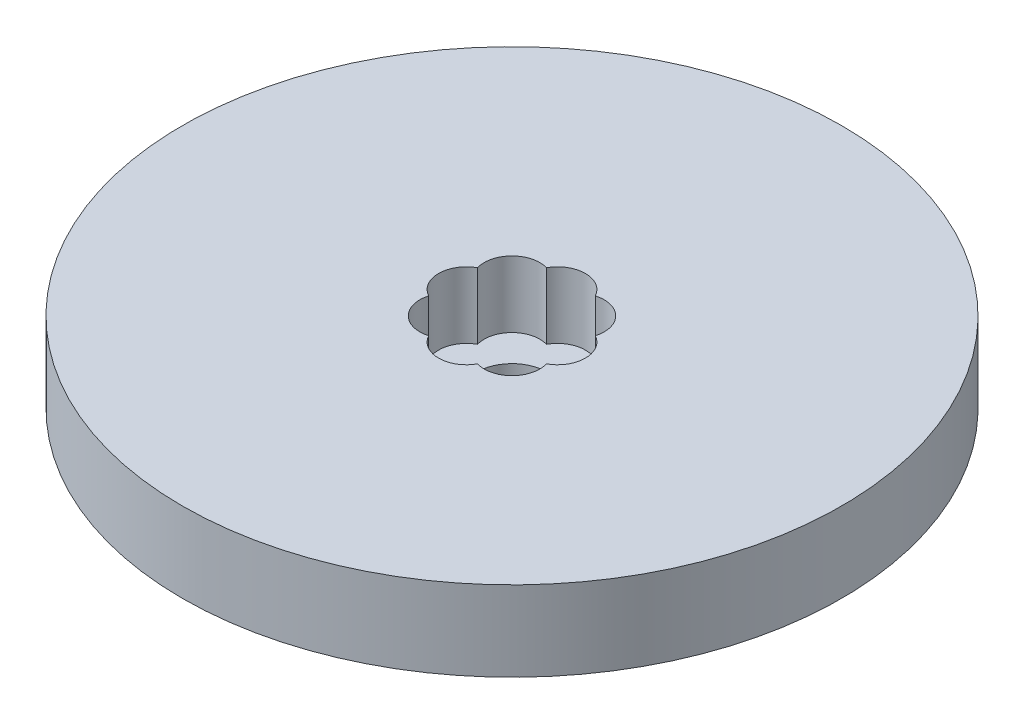
ISO-10303-21;
HEADER;
FILE_DESCRIPTION(('STEP AP214'),'2;1');
FILE_NAME('part.step','',(''),(''),'','','');
FILE_SCHEMA(('AUTOMOTIVE_DESIGN { 1 0 10303 214 1 1 1 1 }'));
ENDSEC;
DATA;
#1=APPLICATION_CONTEXT('core data for automotive mechanical design processes');
#2=APPLICATION_PROTOCOL_DEFINITION('international standard','automotive_design',2000,#1);
#3=PRODUCT_CONTEXT('',#1,'mechanical');
#4=PRODUCT('Part','Part','',(#3));
#5=PRODUCT_RELATED_PRODUCT_CATEGORY('part','',(#4));
#6=PRODUCT_DEFINITION_FORMATION('','',#4);
#7=PRODUCT_DEFINITION_CONTEXT('part definition',#1,'design');
#8=PRODUCT_DEFINITION('design','',#6,#7);
#9=PRODUCT_DEFINITION_SHAPE('','',#8);
#10=(LENGTH_UNIT() NAMED_UNIT(*) SI_UNIT(.MILLI.,.METRE.));
#11=(NAMED_UNIT(*) PLANE_ANGLE_UNIT() SI_UNIT($,.RADIAN.));
#12=(NAMED_UNIT(*) SI_UNIT($,.STERADIAN.) SOLID_ANGLE_UNIT());
#13=UNCERTAINTY_MEASURE_WITH_UNIT(LENGTH_MEASURE(1.E-05),#10,'distance_accuracy_value','');
#14=(GEOMETRIC_REPRESENTATION_CONTEXT(3) GLOBAL_UNCERTAINTY_ASSIGNED_CONTEXT((#13)) GLOBAL_UNIT_ASSIGNED_CONTEXT((#10,
#11,#12)) REPRESENTATION_CONTEXT('',''));
#15=CARTESIAN_POINT('',(0.,0.,0.));
#16=DIRECTION('',(0.,0.,1.));
#17=DIRECTION('',(1.,0.,0.));
#18=AXIS2_PLACEMENT_3D('',#15,#16,#17);
#19=CARTESIAN_POINT('',(0.,17.,0.));
#20=DIRECTION('',(0.,-1.,0.));
#21=DIRECTION('',(0.,0.,-1.));
#22=AXIS2_PLACEMENT_3D('',#19,#20,#21);
#23=CYLINDRICAL_SURFACE('',#22,7.5);
#24=CARTESIAN_POINT('',(0.,0.,0.));
#25=DIRECTION('',(0.,1.,0.));
#26=DIRECTION('',(0.,0.,1.));
#27=AXIS2_PLACEMENT_3D('',#24,#25,#26);
#28=CIRCLE('',#27,7.5);
#29=CARTESIAN_POINT('',(0.,0.,7.5));
#30=VERTEX_POINT('',#29);
#31=EDGE_CURVE('E166',#30,#30,#28,.T.);
#32=ORIENTED_EDGE('',*,*,#31,.F.);
#33=EDGE_LOOP('',(#32));
#34=FACE_BOUND('',#33,.T.);
#35=CARTESIAN_POINT('',(0.,2.90271990847915,0.));
#36=DIRECTION('',(0.,1.,0.));
#37=DIRECTION('',(0.,0.,1.));
#38=AXIS2_PLACEMENT_3D('',#35,#36,#37);
#39=CIRCLE('',#38,7.5);
#40=CARTESIAN_POINT('',(0.,2.90271990847915,7.5));
#41=VERTEX_POINT('',#40);
#42=EDGE_CURVE('E11',#41,#41,#39,.T.);
#43=ORIENTED_EDGE('',*,*,#42,.T.);
#44=EDGE_LOOP('',(#43));
#45=FACE_BOUND('',#44,.T.);
#46=ADVANCED_FACE('F39',(#34,#45),#23,.F.);
#47=CARTESIAN_POINT('',(0.,17.,0.));
#48=DIRECTION('',(0.,-1.,0.));
#49=DIRECTION('',(0.,0.,-1.));
#50=AXIS2_PLACEMENT_3D('',#47,#48,#49);
#51=CYLINDRICAL_SURFACE('',#50,70.);
#52=CARTESIAN_POINT('',(0.,17.,0.));
#53=DIRECTION('',(0.,1.,0.));
#54=DIRECTION('',(0.,0.,1.));
#55=AXIS2_PLACEMENT_3D('',#52,#53,#54);
#56=CIRCLE('',#55,70.);
#57=CARTESIAN_POINT('',(0.,17.,70.));
#58=VERTEX_POINT('',#57);
#59=EDGE_CURVE('E50',#58,#58,#56,.T.);
#60=ORIENTED_EDGE('',*,*,#59,.F.);
#61=EDGE_LOOP('',(#60));
#62=FACE_BOUND('',#61,.T.);
#63=CARTESIAN_POINT('',(0.,0.,0.));
#64=DIRECTION('',(0.,1.,0.));
#65=DIRECTION('',(0.,0.,1.));
#66=AXIS2_PLACEMENT_3D('',#63,#64,#65);
#67=CIRCLE('',#66,70.);
#68=CARTESIAN_POINT('',(0.,0.,70.));
#69=VERTEX_POINT('',#68);
#70=EDGE_CURVE('E173',#69,#69,#67,.T.);
#71=ORIENTED_EDGE('',*,*,#70,.T.);
#72=EDGE_LOOP('',(#71));
#73=FACE_BOUND('',#72,.T.);
#74=ADVANCED_FACE('F41',(#62,#73),#51,.T.);
#75=CARTESIAN_POINT('',(0.,17.,0.));
#76=DIRECTION('',(0.,1.,0.));
#77=DIRECTION('',(0.,0.,1.));
#78=AXIS2_PLACEMENT_3D('',#75,#76,#77);
#79=PLANE('',#78);
#80=CARTESIAN_POINT('',(-6.84222450603892,17.,6.84222450603894));
#81=DIRECTION('',(0.,1.,0.));
#82=DIRECTION('',(0.707106781186549,0.,0.707106781186546));
#83=AXIS2_PLACEMENT_3D('',#80,#81,#82);
#84=CIRCLE('',#83,5.90603717676295);
#85=CARTESIAN_POINT('',(-12.5100627786906,17.,5.18183766907249));
#86=VERTEX_POINT('',#85);
#87=CARTESIAN_POINT('',(-5.18183766907244,17.,12.5100627786906));
#88=VERTEX_POINT('',#87);
#89=EDGE_CURVE('E159',#86,#88,#84,.T.);
#90=ORIENTED_EDGE('',*,*,#89,.F.);
#91=CARTESIAN_POINT('',(-9.67636669324181,17.,0.));
#92=DIRECTION('',(0.,1.,0.));
#93=DIRECTION('',(0.,0.,1.));
#94=AXIS2_PLACEMENT_3D('',#91,#92,#93);
#95=CIRCLE('',#94,5.90603717676295);
#96=CARTESIAN_POINT('',(-12.5100627786907,17.,-5.18183766907243));
#97=VERTEX_POINT('',#96);
#98=EDGE_CURVE('E167',#97,#86,#95,.T.);
#99=ORIENTED_EDGE('',*,*,#98,.F.);
#100=CARTESIAN_POINT('',(-6.84222450603901,17.,-6.84222450603885));
#101=DIRECTION('',(0.,1.,0.));
#102=DIRECTION('',(-0.707106781186539,0.,0.707106781186556));
#103=AXIS2_PLACEMENT_3D('',#100,#101,#102);
#104=CIRCLE('',#103,5.90603717676295);
#105=CARTESIAN_POINT('',(-5.18183766907262,17.,-12.5100627786905));
#106=VERTEX_POINT('',#105);
#107=EDGE_CURVE('E53',#106,#97,#104,.T.);
#108=ORIENTED_EDGE('',*,*,#107,.F.);
#109=CARTESIAN_POINT('',(-1.01354561211771E-13,17.,-9.67636669324181));
#110=DIRECTION('',(0.,1.,0.));
#111=DIRECTION('',(-1.,0.,0.));
#112=AXIS2_PLACEMENT_3D('',#109,#110,#111);
#113=CIRCLE('',#112,5.90603717676295);
#114=CARTESIAN_POINT('',(5.18183766907236,17.,-12.5100627786906));
#115=VERTEX_POINT('',#114);
#116=EDGE_CURVE('E117',#115,#106,#113,.T.);
#117=ORIENTED_EDGE('',*,*,#116,.F.);
#118=CARTESIAN_POINT('',(6.84222450603887,17.,-6.84222450603899));
#119=DIRECTION('',(0.,1.,0.));
#120=DIRECTION('',(-0.707106781186554,0.,-0.707106781186541));
#121=AXIS2_PLACEMENT_3D('',#118,#119,#120);
#122=CIRCLE('',#121,5.90603717676295);
#123=CARTESIAN_POINT('',(12.5100627786905,17.,-5.18183766907252));
#124=VERTEX_POINT('',#123);
#125=EDGE_CURVE('E120',#124,#115,#122,.T.);
#126=ORIENTED_EDGE('',*,*,#125,.F.);
#127=CARTESIAN_POINT('',(9.67636669324181,17.,0.));
#128=DIRECTION('',(0.,1.,0.));
#129=DIRECTION('',(0.,0.,-1.));
#130=AXIS2_PLACEMENT_3D('',#127,#128,#129);
#131=CIRCLE('',#130,5.90603717676295);
#132=CARTESIAN_POINT('',(12.5100627786906,17.,5.18183766907246));
#133=VERTEX_POINT('',#132);
#134=EDGE_CURVE('E136',#133,#124,#131,.T.);
#135=ORIENTED_EDGE('',*,*,#134,.F.);
#136=CARTESIAN_POINT('',(6.84222450603897,17.,6.84222450603889));
#137=DIRECTION('',(0.,1.,0.));
#138=DIRECTION('',(0.707106781186544,0.,-0.707106781186551));
#139=AXIS2_PLACEMENT_3D('',#136,#137,#138);
#140=CIRCLE('',#139,5.90603717676295);
#141=CARTESIAN_POINT('',(5.18183766907253,17.,12.5100627786905));
#142=VERTEX_POINT('',#141);
#143=EDGE_CURVE('E138',#142,#133,#140,.T.);
#144=ORIENTED_EDGE('',*,*,#143,.F.);
#145=CARTESIAN_POINT('',(0.,17.,9.67636669324181));
#146=DIRECTION('',(0.,1.,0.));
#147=DIRECTION('',(1.,0.,0.));
#148=AXIS2_PLACEMENT_3D('',#145,#146,#147);
#149=CIRCLE('',#148,5.90603717676295);
#150=EDGE_CURVE('E146',#88,#142,#149,.T.);
#151=ORIENTED_EDGE('',*,*,#150,.F.);
#152=EDGE_LOOP('',(#90,#99,#108,#117,#126,#135,#144,#151));
#153=FACE_BOUND('',#152,.T.);
#154=ORIENTED_EDGE('',*,*,#59,.T.);
#155=EDGE_LOOP('',(#154));
#156=FACE_BOUND('',#155,.T.);
#157=ADVANCED_FACE('F181',(#153,#156),#79,.T.);
#158=CARTESIAN_POINT('',(0.,0.,0.));
#159=DIRECTION('',(0.,1.,0.));
#160=DIRECTION('',(0.,0.,1.));
#161=AXIS2_PLACEMENT_3D('',#158,#159,#160);
#162=PLANE('',#161);
#163=ORIENTED_EDGE('',*,*,#31,.T.);
#164=EDGE_LOOP('',(#163));
#165=FACE_BOUND('',#164,.T.);
#166=ORIENTED_EDGE('',*,*,#70,.F.);
#167=EDGE_LOOP('',(#166));
#168=FACE_BOUND('',#167,.T.);
#169=ADVANCED_FACE('F179',(#165,#168),#162,.F.);
#170=CARTESIAN_POINT('',(-9.67636669324181,2.90271990847915,0.));
#171=DIRECTION('',(0.,1.,0.));
#172=DIRECTION('',(0.,0.,1.));
#173=AXIS2_PLACEMENT_3D('',#170,#171,#172);
#174=CYLINDRICAL_SURFACE('',#173,5.90603717676295);
#175=ORIENTED_EDGE('',*,*,#98,.T.);
#176=DIRECTION('',(0.,1.,0.));
#177=VECTOR('',#176,1.);
#178=CARTESIAN_POINT('',(-12.5100627786906,9.95135995423958,5.18183766907249));
#179=LINE('',#178,#177);
#180=CARTESIAN_POINT('',(-12.5100627786906,2.90271990847915,5.18183766907249));
#181=VERTEX_POINT('',#180);
#182=EDGE_CURVE('E65',#86,#181,#179,.F.);
#183=ORIENTED_EDGE('',*,*,#182,.T.);
#184=CARTESIAN_POINT('',(-9.67636669324181,2.90271990847915,0.));
#185=DIRECTION('',(0.,1.,0.));
#186=DIRECTION('',(0.,0.,1.));
#187=AXIS2_PLACEMENT_3D('',#184,#185,#186);
#188=CIRCLE('',#187,5.90603717676295);
#189=CARTESIAN_POINT('',(-12.5100627786907,2.90271990847915,-5.18183766907243));
#190=VERTEX_POINT('',#189);
#191=EDGE_CURVE('E170',#190,#181,#188,.T.);
#192=ORIENTED_EDGE('',*,*,#191,.F.);
#193=DIRECTION('',(0.,1.,0.));
#194=VECTOR('',#193,1.);
#195=CARTESIAN_POINT('',(-12.5100627786907,9.95135995423958,-5.18183766907243));
#196=LINE('',#195,#194);
#197=EDGE_CURVE('E124',#190,#97,#196,.T.);
#198=ORIENTED_EDGE('',*,*,#197,.T.);
#199=EDGE_LOOP('',(#175,#183,#192,#198));
#200=FACE_BOUND('',#199,.T.);
#201=ADVANCED_FACE('F185',(#200),#174,.F.);
#202=CARTESIAN_POINT('',(-9.67636669324181,2.90271990847915,0.));
#203=DIRECTION('',(0.,1.,0.));
#204=DIRECTION('',(0.,0.,1.));
#205=AXIS2_PLACEMENT_3D('',#202,#203,#204);
#206=PLANE('',#205);
#207=ORIENTED_EDGE('',*,*,#191,.T.);
#208=CARTESIAN_POINT('',(-6.84222450603892,2.90271990847915,6.84222450603894));
#209=DIRECTION('',(0.,1.,0.));
#210=DIRECTION('',(0.707106781186549,0.,0.707106781186546));
#211=AXIS2_PLACEMENT_3D('',#208,#209,#210);
#212=CIRCLE('',#211,5.90603717676295);
#213=CARTESIAN_POINT('',(-5.18183766907244,2.90271990847915,12.5100627786906));
#214=VERTEX_POINT('',#213);
#215=EDGE_CURVE('E161',#181,#214,#212,.T.);
#216=ORIENTED_EDGE('',*,*,#215,.T.);
#217=CARTESIAN_POINT('',(0.,2.90271990847915,9.67636669324181));
#218=DIRECTION('',(0.,1.,0.));
#219=DIRECTION('',(1.,0.,0.));
#220=AXIS2_PLACEMENT_3D('',#217,#218,#219);
#221=CIRCLE('',#220,5.90603717676295);
#222=CARTESIAN_POINT('',(5.18183766907253,2.90271990847915,12.5100627786905));
#223=VERTEX_POINT('',#222);
#224=EDGE_CURVE('E149',#214,#223,#221,.T.);
#225=ORIENTED_EDGE('',*,*,#224,.T.);
#226=CARTESIAN_POINT('',(6.84222450603897,2.90271990847915,6.84222450603889));
#227=DIRECTION('',(0.,1.,0.));
#228=DIRECTION('',(0.707106781186544,0.,-0.707106781186551));
#229=AXIS2_PLACEMENT_3D('',#226,#227,#228);
#230=CIRCLE('',#229,5.90603717676295);
#231=CARTESIAN_POINT('',(12.5100627786906,2.90271990847915,5.18183766907246));
#232=VERTEX_POINT('',#231);
#233=EDGE_CURVE('E143',#223,#232,#230,.T.);
#234=ORIENTED_EDGE('',*,*,#233,.T.);
#235=CARTESIAN_POINT('',(9.67636669324181,2.90271990847915,0.));
#236=DIRECTION('',(0.,1.,0.));
#237=DIRECTION('',(0.,0.,-1.));
#238=AXIS2_PLACEMENT_3D('',#235,#236,#237);
#239=CIRCLE('',#238,5.90603717676295);
#240=CARTESIAN_POINT('',(12.5100627786905,2.90271990847915,-5.18183766907252));
#241=VERTEX_POINT('',#240);
#242=EDGE_CURVE('E140',#232,#241,#239,.T.);
#243=ORIENTED_EDGE('',*,*,#242,.T.);
#244=CARTESIAN_POINT('',(6.84222450603887,2.90271990847915,-6.84222450603899));
#245=DIRECTION('',(0.,1.,0.));
#246=DIRECTION('',(-0.707106781186554,0.,-0.707106781186541));
#247=AXIS2_PLACEMENT_3D('',#244,#245,#246);
#248=CIRCLE('',#247,5.90603717676295);
#249=CARTESIAN_POINT('',(5.18183766907236,2.90271990847915,-12.5100627786906));
#250=VERTEX_POINT('',#249);
#251=EDGE_CURVE('E111',#241,#250,#248,.T.);
#252=ORIENTED_EDGE('',*,*,#251,.T.);
#253=CARTESIAN_POINT('',(-1.01354561211771E-13,2.90271990847915,-9.67636669324181));
#254=DIRECTION('',(0.,1.,0.));
#255=DIRECTION('',(-1.,0.,0.));
#256=AXIS2_PLACEMENT_3D('',#253,#254,#255);
#257=CIRCLE('',#256,5.90603717676295);
#258=CARTESIAN_POINT('',(-5.18183766907262,2.90271990847915,-12.5100627786905));
#259=VERTEX_POINT('',#258);
#260=EDGE_CURVE('E104',#250,#259,#257,.T.);
#261=ORIENTED_EDGE('',*,*,#260,.T.);
#262=CARTESIAN_POINT('',(-6.84222450603901,2.90271990847915,-6.84222450603885));
#263=DIRECTION('',(0.,1.,0.));
#264=DIRECTION('',(-0.707106781186539,0.,0.707106781186556));
#265=AXIS2_PLACEMENT_3D('',#262,#263,#264);
#266=CIRCLE('',#265,5.90603717676295);
#267=EDGE_CURVE('E112',#259,#190,#266,.T.);
#268=ORIENTED_EDGE('',*,*,#267,.T.);
#269=EDGE_LOOP('',(#207,#216,#225,#234,#243,#252,#261,#268));
#270=FACE_BOUND('',#269,.T.);
#271=ORIENTED_EDGE('',*,*,#42,.F.);
#272=EDGE_LOOP('',(#271));
#273=FACE_BOUND('',#272,.T.);
#274=ADVANCED_FACE('F107',(#270,#273),#206,.T.);
#275=CARTESIAN_POINT('',(-6.84222450603892,2.90271990847915,6.84222450603894));
#276=DIRECTION('',(0.,1.,0.));
#277=DIRECTION('',(0.,0.,1.));
#278=AXIS2_PLACEMENT_3D('',#275,#276,#277);
#279=CYLINDRICAL_SURFACE('',#278,5.90603717676295);
#280=ORIENTED_EDGE('',*,*,#89,.T.);
#281=DIRECTION('',(0.,1.,0.));
#282=VECTOR('',#281,1.);
#283=CARTESIAN_POINT('',(-5.18183766907244,9.95135995423958,12.5100627786906));
#284=LINE('',#283,#282);
#285=EDGE_CURVE('E160',#88,#214,#284,.F.);
#286=ORIENTED_EDGE('',*,*,#285,.T.);
#287=ORIENTED_EDGE('',*,*,#215,.F.);
#288=ORIENTED_EDGE('',*,*,#182,.F.);
#289=EDGE_LOOP('',(#280,#286,#287,#288));
#290=FACE_BOUND('',#289,.T.);
#291=ADVANCED_FACE('F202',(#290),#279,.F.);
#292=CARTESIAN_POINT('',(-6.84222450603901,2.90271990847915,-6.84222450603885));
#293=DIRECTION('',(0.,1.,0.));
#294=DIRECTION('',(0.,0.,1.));
#295=AXIS2_PLACEMENT_3D('',#292,#293,#294);
#296=CYLINDRICAL_SURFACE('',#295,5.90603717676295);
#297=ORIENTED_EDGE('',*,*,#267,.F.);
#298=DIRECTION('',(0.,1.,0.));
#299=VECTOR('',#298,1.);
#300=CARTESIAN_POINT('',(-5.18183766907262,9.95135995423958,-12.5100627786905));
#301=LINE('',#300,#299);
#302=EDGE_CURVE('E119',#106,#259,#301,.F.);
#303=ORIENTED_EDGE('',*,*,#302,.F.);
#304=ORIENTED_EDGE('',*,*,#107,.T.);
#305=ORIENTED_EDGE('',*,*,#197,.F.);
#306=EDGE_LOOP('',(#297,#303,#304,#305));
#307=FACE_BOUND('',#306,.T.);
#308=ADVANCED_FACE('F123',(#307),#296,.F.);
#309=CARTESIAN_POINT('',(0.,2.90271990847915,9.67636669324181));
#310=DIRECTION('',(0.,1.,0.));
#311=DIRECTION('',(0.,0.,1.));
#312=AXIS2_PLACEMENT_3D('',#309,#310,#311);
#313=CYLINDRICAL_SURFACE('',#312,5.90603717676295);
#314=ORIENTED_EDGE('',*,*,#150,.T.);
#315=DIRECTION('',(0.,1.,0.));
#316=VECTOR('',#315,1.);
#317=CARTESIAN_POINT('',(5.18183766907253,9.95135995423958,12.5100627786905));
#318=LINE('',#317,#316);
#319=EDGE_CURVE('E141',#142,#223,#318,.F.);
#320=ORIENTED_EDGE('',*,*,#319,.T.);
#321=ORIENTED_EDGE('',*,*,#224,.F.);
#322=ORIENTED_EDGE('',*,*,#285,.F.);
#323=EDGE_LOOP('',(#314,#320,#321,#322));
#324=FACE_BOUND('',#323,.T.);
#325=ADVANCED_FACE('F208',(#324),#313,.F.);
#326=CARTESIAN_POINT('',(6.84222450603897,2.90271990847915,6.84222450603889));
#327=DIRECTION('',(0.,1.,0.));
#328=DIRECTION('',(0.,0.,1.));
#329=AXIS2_PLACEMENT_3D('',#326,#327,#328);
#330=CYLINDRICAL_SURFACE('',#329,5.90603717676295);
#331=DIRECTION('',(0.,1.,0.));
#332=VECTOR('',#331,1.);
#333=CARTESIAN_POINT('',(12.5100627786906,9.95135995423958,5.18183766907246));
#334=LINE('',#333,#332);
#335=EDGE_CURVE('E151',#133,#232,#334,.F.);
#336=ORIENTED_EDGE('',*,*,#335,.T.);
#337=ORIENTED_EDGE('',*,*,#233,.F.);
#338=ORIENTED_EDGE('',*,*,#319,.F.);
#339=ORIENTED_EDGE('',*,*,#143,.T.);
#340=EDGE_LOOP('',(#336,#337,#338,#339));
#341=FACE_BOUND('',#340,.T.);
#342=ADVANCED_FACE('F211',(#341),#330,.F.);
#343=CARTESIAN_POINT('',(9.67636669324181,2.90271990847915,0.));
#344=DIRECTION('',(0.,1.,0.));
#345=DIRECTION('',(0.,0.,1.));
#346=AXIS2_PLACEMENT_3D('',#343,#344,#345);
#347=CYLINDRICAL_SURFACE('',#346,5.90603717676295);
#348=ORIENTED_EDGE('',*,*,#134,.T.);
#349=DIRECTION('',(0.,1.,0.));
#350=VECTOR('',#349,1.);
#351=CARTESIAN_POINT('',(12.5100627786905,9.95135995423958,-5.18183766907252));
#352=LINE('',#351,#350);
#353=EDGE_CURVE('E131',#124,#241,#352,.F.);
#354=ORIENTED_EDGE('',*,*,#353,.T.);
#355=ORIENTED_EDGE('',*,*,#242,.F.);
#356=ORIENTED_EDGE('',*,*,#335,.F.);
#357=EDGE_LOOP('',(#348,#354,#355,#356));
#358=FACE_BOUND('',#357,.T.);
#359=ADVANCED_FACE('F214',(#358),#347,.F.);
#360=CARTESIAN_POINT('',(6.84222450603887,2.90271990847915,-6.84222450603899));
#361=DIRECTION('',(0.,1.,0.));
#362=DIRECTION('',(0.,0.,1.));
#363=AXIS2_PLACEMENT_3D('',#360,#361,#362);
#364=CYLINDRICAL_SURFACE('',#363,5.90603717676295);
#365=DIRECTION('',(0.,1.,0.));
#366=VECTOR('',#365,1.);
#367=CARTESIAN_POINT('',(5.18183766907236,9.95135995423958,-12.5100627786906));
#368=LINE('',#367,#366);
#369=EDGE_CURVE('E154',#115,#250,#368,.F.);
#370=ORIENTED_EDGE('',*,*,#369,.T.);
#371=ORIENTED_EDGE('',*,*,#251,.F.);
#372=ORIENTED_EDGE('',*,*,#353,.F.);
#373=ORIENTED_EDGE('',*,*,#125,.T.);
#374=EDGE_LOOP('',(#370,#371,#372,#373));
#375=FACE_BOUND('',#374,.T.);
#376=ADVANCED_FACE('F218',(#375),#364,.F.);
#377=CARTESIAN_POINT('',(-1.01354561211771E-13,2.90271990847915,-9.67636669324181));
#378=DIRECTION('',(0.,1.,0.));
#379=DIRECTION('',(0.,0.,1.));
#380=AXIS2_PLACEMENT_3D('',#377,#378,#379);
#381=CYLINDRICAL_SURFACE('',#380,5.90603717676295);
#382=ORIENTED_EDGE('',*,*,#116,.T.);
#383=ORIENTED_EDGE('',*,*,#302,.T.);
#384=ORIENTED_EDGE('',*,*,#260,.F.);
#385=ORIENTED_EDGE('',*,*,#369,.F.);
#386=EDGE_LOOP('',(#382,#383,#384,#385));
#387=FACE_BOUND('',#386,.T.);
#388=ADVANCED_FACE('F121',(#387),#381,.F.);
#389=CLOSED_SHELL('',(#46,#74,#157,#169,#201,#274,#291,#308,#325,#342,#359,#376,#388));
#390=MANIFOLD_SOLID_BREP('B2',#389);
#391=ADVANCED_BREP_SHAPE_REPRESENTATION('',(#18,#390),#14);
#392=SHAPE_DEFINITION_REPRESENTATION(#9,#391);
ENDSEC;
END-ISO-10303-21;
